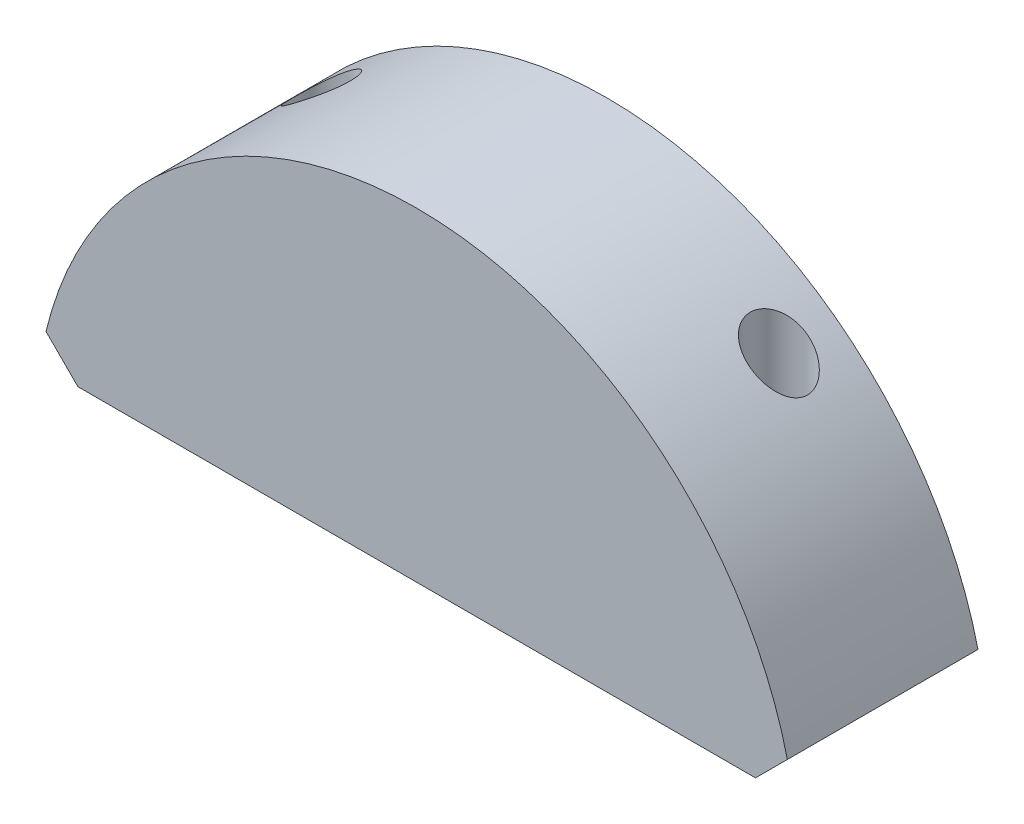
ISO-10303-21;
HEADER;
FILE_DESCRIPTION(('STEP AP214'),'2;1');
FILE_NAME('part.step','',(''),(''),'','','');
FILE_SCHEMA(('AUTOMOTIVE_DESIGN { 1 0 10303 214 1 1 1 1 }'));
ENDSEC;
DATA;
#1=APPLICATION_CONTEXT('core data for automotive mechanical design processes');
#2=APPLICATION_PROTOCOL_DEFINITION('international standard','automotive_design',2000,#1);
#3=PRODUCT_CONTEXT('',#1,'mechanical');
#4=PRODUCT('Part','Part','',(#3));
#5=PRODUCT_RELATED_PRODUCT_CATEGORY('part','',(#4));
#6=PRODUCT_DEFINITION_FORMATION('','',#4);
#7=PRODUCT_DEFINITION_CONTEXT('part definition',#1,'design');
#8=PRODUCT_DEFINITION('design','',#6,#7);
#9=PRODUCT_DEFINITION_SHAPE('','',#8);
#10=(LENGTH_UNIT() NAMED_UNIT(*) SI_UNIT(.MILLI.,.METRE.));
#11=(NAMED_UNIT(*) PLANE_ANGLE_UNIT() SI_UNIT($,.RADIAN.));
#12=(NAMED_UNIT(*) SI_UNIT($,.STERADIAN.) SOLID_ANGLE_UNIT());
#13=UNCERTAINTY_MEASURE_WITH_UNIT(LENGTH_MEASURE(1.E-05),#10,'distance_accuracy_value','');
#14=(GEOMETRIC_REPRESENTATION_CONTEXT(3) GLOBAL_UNCERTAINTY_ASSIGNED_CONTEXT((#13)) GLOBAL_UNIT_ASSIGNED_CONTEXT((#10,
#11,#12)) REPRESENTATION_CONTEXT('',''));
#15=CARTESIAN_POINT('',(0.,0.,0.));
#16=DIRECTION('',(0.,0.,1.));
#17=DIRECTION('',(1.,0.,0.));
#18=AXIS2_PLACEMENT_3D('',#15,#16,#17);
#19=CARTESIAN_POINT('',(-19.4464743814244,4.67275444813921,10.));
#20=DIRECTION('',(0.707106781186549,0.707106781186546,0.));
#21=DIRECTION('',(-0.707106781186546,0.707106781186549,0.));
#22=AXIS2_PLACEMENT_3D('',#19,#20,#21);
#23=PLANE('',#22);
#24=DIRECTION('',(0.707106781186546,-0.707106781186549,0.));
#25=VECTOR('',#24,1.);
#26=CARTESIAN_POINT('',(-19.4464743814244,4.67275444813921,0.));
#27=LINE('',#26,#25);
#28=CARTESIAN_POINT('',(-19.4464743814244,4.67275444813921,0.));
#29=VERTEX_POINT('',#28);
#30=CARTESIAN_POINT('',(-17.7737199332852,3.,0.));
#31=VERTEX_POINT('',#30);
#32=EDGE_CURVE('E100',#29,#31,#27,.T.);
#33=ORIENTED_EDGE('',*,*,#32,.T.);
#34=DIRECTION('',(0.,0.,-1.));
#35=VECTOR('',#34,1.);
#36=CARTESIAN_POINT('',(-17.7737199332852,3.,10.));
#37=LINE('',#36,#35);
#38=CARTESIAN_POINT('',(-17.7737199332852,3.,10.));
#39=VERTEX_POINT('',#38);
#40=EDGE_CURVE('E11',#39,#31,#37,.T.);
#41=ORIENTED_EDGE('',*,*,#40,.F.);
#42=DIRECTION('',(0.707106781186546,-0.707106781186549,0.));
#43=VECTOR('',#42,1.);
#44=CARTESIAN_POINT('',(-19.4464743814244,4.67275444813921,10.));
#45=LINE('',#44,#43);
#46=CARTESIAN_POINT('',(-19.4464743814244,4.67275444813921,10.));
#47=VERTEX_POINT('',#46);
#48=EDGE_CURVE('E87',#47,#39,#45,.T.);
#49=ORIENTED_EDGE('',*,*,#48,.F.);
#50=DIRECTION('',(0.,0.,-1.));
#51=VECTOR('',#50,1.);
#52=CARTESIAN_POINT('',(-19.4464743814244,4.67275444813921,10.));
#53=LINE('',#52,#51);
#54=EDGE_CURVE('E96',#47,#29,#53,.T.);
#55=ORIENTED_EDGE('',*,*,#54,.T.);
#56=EDGE_LOOP('',(#33,#41,#49,#55));
#57=FACE_BOUND('',#56,.T.);
#58=ADVANCED_FACE('F30',(#57),#23,.F.);
#59=CARTESIAN_POINT('',(17.7737199332852,3.,10.));
#60=DIRECTION('',(0.,1.,0.));
#61=DIRECTION('',(0.,0.,1.));
#62=AXIS2_PLACEMENT_3D('',#59,#60,#61);
#63=PLANE('',#62);
#64=CARTESIAN_POINT('',(12.,3.,3.));
#65=DIRECTION('',(0.,-1.,0.));
#66=DIRECTION('',(0.,0.,1.));
#67=AXIS2_PLACEMENT_3D('',#64,#65,#66);
#68=CIRCLE('',#67,1.5);
#69=CARTESIAN_POINT('',(12.,3.,4.5));
#70=VERTEX_POINT('',#69);
#71=EDGE_CURVE('E148',#70,#70,#68,.T.);
#72=ORIENTED_EDGE('',*,*,#71,.F.);
#73=EDGE_LOOP('',(#72));
#74=FACE_BOUND('',#73,.T.);
#75=CARTESIAN_POINT('',(-12.,3.,3.));
#76=DIRECTION('',(0.,-1.,0.));
#77=DIRECTION('',(0.,0.,-1.));
#78=AXIS2_PLACEMENT_3D('',#75,#76,#77);
#79=CIRCLE('',#78,1.5);
#80=CARTESIAN_POINT('',(-12.,3.,1.5));
#81=VERTEX_POINT('',#80);
#82=EDGE_CURVE('E112',#81,#81,#79,.T.);
#83=ORIENTED_EDGE('',*,*,#82,.F.);
#84=EDGE_LOOP('',(#83));
#85=FACE_BOUND('',#84,.T.);
#86=DIRECTION('',(1.,0.,0.));
#87=VECTOR('',#86,1.);
#88=CARTESIAN_POINT('',(17.7737199332852,3.,0.));
#89=LINE('',#88,#87);
#90=CARTESIAN_POINT('',(17.7737199332852,3.,0.));
#91=VERTEX_POINT('',#90);
#92=EDGE_CURVE('E91',#31,#91,#89,.T.);
#93=ORIENTED_EDGE('',*,*,#92,.T.);
#94=DIRECTION('',(0.,0.,-1.));
#95=VECTOR('',#94,1.);
#96=CARTESIAN_POINT('',(17.7737199332852,3.,10.));
#97=LINE('',#96,#95);
#98=CARTESIAN_POINT('',(17.7737199332852,3.,10.));
#99=VERTEX_POINT('',#98);
#100=EDGE_CURVE('E43',#99,#91,#97,.T.);
#101=ORIENTED_EDGE('',*,*,#100,.F.);
#102=DIRECTION('',(1.,0.,0.));
#103=VECTOR('',#102,1.);
#104=CARTESIAN_POINT('',(17.7737199332852,3.,10.));
#105=LINE('',#104,#103);
#106=EDGE_CURVE('E82',#39,#99,#105,.T.);
#107=ORIENTED_EDGE('',*,*,#106,.F.);
#108=ORIENTED_EDGE('',*,*,#40,.T.);
#109=EDGE_LOOP('',(#93,#101,#107,#108));
#110=FACE_BOUND('',#109,.T.);
#111=ADVANCED_FACE('F90',(#74,#85,#110),#63,.F.);
#112=CARTESIAN_POINT('',(19.4464743814244,4.67275444813921,10.));
#113=DIRECTION('',(-0.707106781186549,0.707106781186546,0.));
#114=DIRECTION('',(-0.707106781186546,-0.707106781186549,0.));
#115=AXIS2_PLACEMENT_3D('',#112,#113,#114);
#116=PLANE('',#115);
#117=DIRECTION('',(0.707106781186546,0.707106781186549,0.));
#118=VECTOR('',#117,1.);
#119=CARTESIAN_POINT('',(19.4464743814244,4.67275444813921,0.));
#120=LINE('',#119,#118);
#121=CARTESIAN_POINT('',(19.4464743814244,4.67275444813921,0.));
#122=VERTEX_POINT('',#121);
#123=EDGE_CURVE('E69',#91,#122,#120,.T.);
#124=ORIENTED_EDGE('',*,*,#123,.T.);
#125=DIRECTION('',(0.,0.,-1.));
#126=VECTOR('',#125,1.);
#127=CARTESIAN_POINT('',(19.4464743814244,4.67275444813921,10.));
#128=LINE('',#127,#126);
#129=CARTESIAN_POINT('',(19.4464743814244,4.67275444813921,10.));
#130=VERTEX_POINT('',#129);
#131=EDGE_CURVE('E92',#130,#122,#128,.T.);
#132=ORIENTED_EDGE('',*,*,#131,.F.);
#133=DIRECTION('',(0.707106781186546,0.707106781186549,0.));
#134=VECTOR('',#133,1.);
#135=CARTESIAN_POINT('',(19.4464743814244,4.67275444813921,10.));
#136=LINE('',#135,#134);
#137=EDGE_CURVE('E85',#99,#130,#136,.T.);
#138=ORIENTED_EDGE('',*,*,#137,.F.);
#139=ORIENTED_EDGE('',*,*,#100,.T.);
#140=EDGE_LOOP('',(#124,#132,#138,#139));
#141=FACE_BOUND('',#140,.T.);
#142=ADVANCED_FACE('F94',(#141),#116,.F.);
#143=CARTESIAN_POINT('',(0.,0.,10.));
#144=DIRECTION('',(0.,0.,-1.));
#145=DIRECTION('',(-1.,0.,0.));
#146=AXIS2_PLACEMENT_3D('',#143,#144,#145);
#147=CYLINDRICAL_SURFACE('',#146,20.);
#148=CARTESIAN_POINT('',(12.,16.,1.5));
#149=CARTESIAN_POINT('',(12.1016605629213,15.9237532135887,1.50000004935669));
#150=CARTESIAN_POINT('',(12.2026127311578,15.8465127533473,1.51032097749191));
#151=CARTESIAN_POINT('',(12.400646022508,15.692029679866,1.55095839595559));
#152=CARTESIAN_POINT('',(12.4977205734092,15.6147872679916,1.58130742401025));
#153=CARTESIAN_POINT('',(12.6897064755142,15.4592138939535,1.6636898259232));
#154=CARTESIAN_POINT('',(12.7843139264481,15.3809957521567,1.71665472820429));
#155=CARTESIAN_POINT('',(12.9629089448135,15.2307751019965,1.8446545508195));
#156=CARTESIAN_POINT('',(13.0469231451528,15.1587571563415,1.91963247924919));
#157=CARTESIAN_POINT('',(13.1708907683445,15.0509697154233,2.05968444424559));
#158=CARTESIAN_POINT('',(13.2155595966016,15.0117279077581,2.11794607225101));
#159=CARTESIAN_POINT('',(13.2971797886314,14.9394765813178,2.24310888920046));
#160=CARTESIAN_POINT('',(13.3341434417936,14.9064571463541,2.30999604067372));
#161=CARTESIAN_POINT('',(13.3928015616609,14.8537589270902,2.43942400994441));
#162=CARTESIAN_POINT('',(13.4160296580088,14.8327617291017,2.50072726708063));
#163=CARTESIAN_POINT('',(13.4545746078482,14.7978073911107,2.62770451371876));
#164=CARTESIAN_POINT('',(13.4698962264855,14.7838460108185,2.69337584362389));
#165=CARTESIAN_POINT('',(13.4916421076157,14.7640041775769,2.82778097939976));
#166=CARTESIAN_POINT('',(13.4980169893861,14.7581685755147,2.89652963762857));
#167=CARTESIAN_POINT('',(13.5011884754028,14.755267420131,3.03442992687101));
#168=CARTESIAN_POINT('',(13.4979872687585,14.7581998624203,3.10358146217928));
#169=CARTESIAN_POINT('',(13.4830012003276,14.7718909613274,3.23367914475481));
#170=CARTESIAN_POINT('',(13.472021382519,14.7819154999464,3.2948005649622));
#171=CARTESIAN_POINT('',(13.4430616303673,14.8082569634209,3.41392436688357));
#172=CARTESIAN_POINT('',(13.4250804124258,14.8245750420944,3.47192617444432));
#173=CARTESIAN_POINT('',(13.3816034948475,14.8638351659176,3.58757468259506));
#174=CARTESIAN_POINT('',(13.3556818304176,14.8871505567923,3.64493207249858));
#175=CARTESIAN_POINT('',(13.2980418159378,14.93866067761,3.75426441770425));
#176=CARTESIAN_POINT('',(13.2663196593158,14.9668586110726,3.80623580314361));
#177=CARTESIAN_POINT('',(13.1803316644731,15.0427260154491,3.9301005770873));
#178=CARTESIAN_POINT('',(13.1229220222838,15.0928947956917,3.99829629684761));
#179=CARTESIAN_POINT('',(12.9998708818308,15.1990132172518,4.12155049099019));
#180=CARTESIAN_POINT('',(12.9342108196884,15.2549758433967,4.17657849984266));
#181=CARTESIAN_POINT('',(12.7798704471203,15.384647055898,4.28560543116446));
#182=CARTESIAN_POINT('',(12.6894951910277,15.4593402629862,4.3360376663896));
#183=CARTESIAN_POINT('',(12.5022544047574,15.6111562300716,4.41709380697448));
#184=CARTESIAN_POINT('',(12.4053874483738,15.6882795219658,4.44771334369915));
#185=CARTESIAN_POINT('',(12.2069126063822,15.8432077026678,4.48913684669305));
#186=CARTESIAN_POINT('',(12.1052767364364,15.9210136356196,4.49980331807073));
#187=CARTESIAN_POINT('',(11.9004066568021,16.0747230306896,4.50019129806755));
#188=CARTESIAN_POINT('',(11.7971717440038,16.1506256151288,4.48990331756371));
#189=CARTESIAN_POINT('',(11.5899659066436,16.2999799219,4.44683044842385));
#190=CARTESIAN_POINT('',(11.4860287279132,16.3733410304183,4.41355576711111));
#191=CARTESIAN_POINT('',(11.2842193016896,16.5130665721538,4.32281232383724));
#192=CARTESIAN_POINT('',(11.1863337294807,16.5794466204968,4.26539905840293));
#193=CARTESIAN_POINT('',(11.0315673658264,16.6826343905496,4.14819763134881));
#194=CARTESIAN_POINT('',(10.9715216369123,16.7221477658731,4.09492647133967));
#195=CARTESIAN_POINT('',(10.8591649159862,16.7953271487328,3.97728953681393));
#196=CARTESIAN_POINT('',(10.806849595253,16.8289964305881,3.91293001540785));
#197=CARTESIAN_POINT('',(10.7121014961134,16.8894665285848,3.77360389767993));
#198=CARTESIAN_POINT('',(10.6697416979466,16.9162167589897,3.69856507407423));
#199=CARTESIAN_POINT('',(10.5979555941409,16.9612839160065,3.54019315187877));
#200=CARTESIAN_POINT('',(10.5685197408551,16.979607068653,3.45686623218194));
#201=CARTESIAN_POINT('',(10.5273605290395,17.0051519510712,3.29560140167121));
#202=CARTESIAN_POINT('',(10.5138907603318,17.0134701997499,3.21828040882406));
#203=CARTESIAN_POINT('',(10.4992362845085,17.0225179869444,3.06205860237886));
#204=CARTESIAN_POINT('',(10.4980447598979,17.023251736754,2.9831586898644));
#205=CARTESIAN_POINT('',(10.5076087948478,17.0173493215066,2.8326505627828));
#206=CARTESIAN_POINT('',(10.5174310204263,17.0112889192493,2.76095738189619));
#207=CARTESIAN_POINT('',(10.5470279795145,16.9929544491812,2.62049671268837));
#208=CARTESIAN_POINT('',(10.5668022281685,16.9806806840812,2.55172908201334));
#209=CARTESIAN_POINT('',(10.6156676939691,16.950175007428,2.41796748732423));
#210=CARTESIAN_POINT('',(10.6448759171302,16.9318682092376,2.35303371512348));
#211=CARTESIAN_POINT('',(10.711248859622,16.8899580945463,2.22924846857253));
#212=CARTESIAN_POINT('',(10.748415802057,16.8663532980698,2.17039870048799));
#213=CARTESIAN_POINT('',(10.8329398860586,16.8122022490995,2.05472177457169));
#214=CARTESIAN_POINT('',(10.8809116539043,16.781223570887,1.99854817905675));
#215=CARTESIAN_POINT('',(10.9828767468486,16.7146680692949,1.89512800668807));
#216=CARTESIAN_POINT('',(11.0368729409546,16.679089053808,1.8478857122846));
#217=CARTESIAN_POINT('',(11.1574088396454,16.5987406196212,1.7563920114594));
#218=CARTESIAN_POINT('',(11.2246335533111,16.553386112853,1.71355962226389));
#219=CARTESIAN_POINT('',(11.3627962910017,16.4588542389145,1.63981128319862));
#220=CARTESIAN_POINT('',(11.4337361929509,16.4096749322021,1.60890142717381));
#221=CARTESIAN_POINT('',(11.5867739353569,16.3020390843075,1.55548706424555));
#222=CARTESIAN_POINT('',(11.6691455209899,16.2431971369261,1.53454650227289));
#223=CARTESIAN_POINT('',(11.8345001333518,16.1231224094826,1.50679968712444));
#224=CARTESIAN_POINT('',(11.9174834246622,16.0618885388235,1.4999999599378));
#225=CARTESIAN_POINT('',(12.,16.,1.5));
#226=B_SPLINE_CURVE_WITH_KNOTS('',3,(#148,#149,#150,#151,#152,#153,#154,#155,#156,#157,#158,
#159,#160,#161,#162,#163,#164,#165,#166,#167,#168,#169,#170,#171,#172,#173,#174,#175,#176,#177,
#178,#179,#180,#181,#182,#183,#184,#185,#186,#187,#188,#189,#190,#191,#192,#193,#194,#195,#196,
#197,#198,#199,#200,#201,#202,#203,#204,#205,#206,#207,#208,#209,#210,#211,#212,#213,#214,#215,
#216,#217,#218,#219,#220,#221,#222,#223,#224,#225),.UNSPECIFIED.,.T.,.F.,(4,2,2,2,2,2,2,2,2,2,2,
2,2,2,2,2,2,2,2,2,2,2,2,2,2,2,2,2,2,2,2,2,2,2,2,2,2,2,4),(0.,0.380888747448679,
0.762397816573691,1.16142131309411,1.55942070996349,1.80831992799634,2.0568190736621,
2.26249204307297,2.46804091048419,2.67471988367374,2.88135161332349,3.06923797234161,
3.25715879364833,3.45778881821749,3.65855098185161,3.96373327729259,4.26961497597764,
4.65056330466912,5.03159560261999,5.41524402539658,5.79906622014662,6.19132971875762,
6.5826962617878,6.85005253143594,7.11725852021268,7.38636612164722,7.6552745822342,
7.89076947911889,8.12613361041182,8.34296500964324,8.55978584602022,8.7794063241254,
8.99908822889552,9.23845155373437,9.47792936089045,9.7520175092024,10.0262455643914,
10.3352654956433,10.644428007841),.UNSPECIFIED.);
#227=CARTESIAN_POINT('',(12.,16.,1.5));
#228=VERTEX_POINT('',#227);
#229=EDGE_CURVE('E33',#228,#228,#226,.T.);
#230=ORIENTED_EDGE('',*,*,#229,.T.);
#231=EDGE_LOOP('',(#230));
#232=FACE_BOUND('',#231,.T.);
#233=CARTESIAN_POINT('',(-12.,16.,1.5));
#234=CARTESIAN_POINT('',(-11.8980876048335,16.0764323170644,1.5000003600341));
#235=CARTESIAN_POINT('',(-11.795374042595,16.1519339106007,1.51037246279794));
#236=CARTESIAN_POINT('',(-11.5913536327377,16.2989669800117,1.55298029084801));
#237=CARTESIAN_POINT('',(-11.490048209334,16.3704946286235,1.58523671089141));
#238=CARTESIAN_POINT('',(-11.3142543425323,16.4923175647519,1.66324681195698));
#239=CARTESIAN_POINT('',(-11.238684524381,16.5438706292671,1.70460518809169));
#240=CARTESIAN_POINT('',(-11.0935488275665,16.6415381162207,1.80169184783767));
#241=CARTESIAN_POINT('',(-11.0239734845288,16.6876611556738,1.85739690400877));
#242=CARTESIAN_POINT('',(-10.9036247460083,16.7664950196489,1.9734244783802));
#243=CARTESIAN_POINT('',(-10.8515983746704,16.8001794997242,2.03178224968919));
#244=CARTESIAN_POINT('',(-10.7561004107026,16.8614804890711,2.15799817758912));
#245=CARTESIAN_POINT('',(-10.7126274551483,16.8890979651574,2.22585481765071));
#246=CARTESIAN_POINT('',(-10.6361897009943,16.9373414907645,2.37014029400427));
#247=CARTESIAN_POINT('',(-10.6032891874942,16.9579248158376,2.44661788923494));
#248=CARTESIAN_POINT('',(-10.5503692934813,16.9909003915396,2.60557412620413));
#249=CARTESIAN_POINT('',(-10.5303416713673,17.0032978831174,2.68804889064996));
#250=CARTESIAN_POINT('',(-10.5059450850056,17.0183811355177,2.84666531717342));
#251=CARTESIAN_POINT('',(-10.5000833890813,17.0219930061228,2.92249230541015));
#252=CARTESIAN_POINT('',(-10.4999184896842,17.0220948966151,3.07414954399625));
#253=CARTESIAN_POINT('',(-10.5056110395502,17.0185875331139,3.14997978290739));
#254=CARTESIAN_POINT('',(-10.5276429980599,17.0049664536379,3.29547769185223));
#255=CARTESIAN_POINT('',(-10.5434291725354,16.9951959546369,3.36526304483569));
#256=CARTESIAN_POINT('',(-10.5843294661826,16.969753845377,3.50089488696362));
#257=CARTESIAN_POINT('',(-10.6094442044875,16.9540818434367,3.566741114333));
#258=CARTESIAN_POINT('',(-10.6689917240703,16.9166749481416,3.69543796905904));
#259=CARTESIAN_POINT('',(-10.7037411921448,16.894733040342,3.75808090296772));
#260=CARTESIAN_POINT('',(-10.7806361565001,16.8457697707144,3.87643513553549));
#261=CARTESIAN_POINT('',(-10.822784220928,16.8187466448983,3.9321440157829));
#262=CARTESIAN_POINT('',(-10.9178890891895,16.7571845534856,4.04155760309163));
#263=CARTESIAN_POINT('',(-10.9715220318902,16.7221486702822,4.09439267118534));
#264=CARTESIAN_POINT('',(-11.0841830982763,16.6476860793537,4.1902774291558));
#265=CARTESIAN_POINT('',(-11.1432139512592,16.6082571481853,4.23332213002933));
#266=CARTESIAN_POINT('',(-11.274541163793,16.5194409670355,4.31552589431466));
#267=CARTESIAN_POINT('',(-11.3474700975539,16.4694598846249,4.35303035551361));
#268=CARTESIAN_POINT('',(-11.4962221492973,16.365974093831,4.41517346469698));
#269=CARTESIAN_POINT('',(-11.57204683658,16.3124674631152,4.43980502715793));
#270=CARTESIAN_POINT('',(-11.7381442890676,16.1934588757011,4.47984368956888));
#271=CARTESIAN_POINT('',(-11.8286439442075,16.1274849369142,4.4929128422832));
#272=CARTESIAN_POINT('',(-12.0091013673207,15.9935657699963,4.50269618316554));
#273=CARTESIAN_POINT('',(-12.0990586138851,15.9256189261905,4.49939656809969));
#274=CARTESIAN_POINT('',(-12.2890846402055,15.7795653555701,4.47541502690279));
#275=CARTESIAN_POINT('',(-12.3887946092472,15.7013746346254,4.45235201009592));
#276=CARTESIAN_POINT('',(-12.5825891709098,15.5465051671632,4.38603019746868));
#277=CARTESIAN_POINT('',(-12.6766737297221,15.4698264297345,4.34277128028547));
#278=CARTESIAN_POINT('',(-12.8411398943842,15.3334455836701,4.24499890082287));
#279=CARTESIAN_POINT('',(-12.9128361125113,15.2730688976113,4.1936358138155));
#280=CARTESIAN_POINT('',(-13.0483034816434,15.1574951967083,4.07659138836794));
#281=CARTESIAN_POINT('',(-13.1120862077628,15.1022906462167,4.0109313591837));
#282=CARTESIAN_POINT('',(-13.2148223778713,15.0123937614299,3.8827425817465));
#283=CARTESIAN_POINT('',(-13.2560565832223,14.9759628036903,3.82326569708388));
#284=CARTESIAN_POINT('',(-13.3306489346558,14.9096037748145,3.69625877104046));
#285=CARTESIAN_POINT('',(-13.3640173563308,14.8796672237292,3.62873941171168));
#286=CARTESIAN_POINT('',(-13.4160912652458,14.8327177492785,3.49872011198761));
#287=CARTESIAN_POINT('',(-13.4363251312712,14.8143729529233,3.43731832757045));
#288=CARTESIAN_POINT('',(-13.4688959978802,14.7847668318338,3.31080612958904));
#289=CARTESIAN_POINT('',(-13.4812382565596,14.7735007906854,3.24569821694375));
#290=CARTESIAN_POINT('',(-13.4972125275386,14.7589084124947,3.11323211597964));
#291=CARTESIAN_POINT('',(-13.5008065126064,14.7556167389417,3.04586538928481));
#292=CARTESIAN_POINT('',(-13.498888726625,14.7573711983825,2.91137397683958));
#293=CARTESIAN_POINT('',(-13.4933773865565,14.7624169367433,2.84424927978396));
#294=CARTESIAN_POINT('',(-13.4743664275154,14.7797697752896,2.71698321890953));
#295=CARTESIAN_POINT('',(-13.4614456888825,14.7915505002326,2.65667996533801));
#296=CARTESIAN_POINT('',(-13.4288598155293,14.8211405270667,2.53949536743534));
#297=CARTESIAN_POINT('',(-13.409192016344,14.8389522105928,2.48261538542665));
#298=CARTESIAN_POINT('',(-13.3564790722021,14.886440101642,2.35486471316348));
#299=CARTESIAN_POINT('',(-13.3211599585108,14.9180920605353,2.28566605417657));
#300=CARTESIAN_POINT('',(-13.2422954098062,14.9881420541817,2.15590632220091));
#301=CARTESIAN_POINT('',(-13.1987348329528,15.0265524968956,2.09536151394654));
#302=CARTESIAN_POINT('',(-13.0908551109943,15.1207161398019,1.9660109217337));
#303=CARTESIAN_POINT('',(-13.0242636211823,15.1781786427428,1.90035103105235));
#304=CARTESIAN_POINT('',(-12.8830820444135,15.2981964808271,1.78404266330934));
#305=CARTESIAN_POINT('',(-12.8084817401896,15.3607582963496,1.73341367942219));
#306=CARTESIAN_POINT('',(-12.6519333620279,15.4899672505474,1.64605381787775));
#307=CARTESIAN_POINT('',(-12.5698699134902,15.5566704339982,1.60961485293945));
#308=CARTESIAN_POINT('',(-12.4016331516331,15.6911140433194,1.55204375884532));
#309=CARTESIAN_POINT('',(-12.3154680566121,15.7588522245281,1.53088228976567));
#310=CARTESIAN_POINT('',(-12.1527976286699,15.8845389200665,1.50586275371052));
#311=CARTESIAN_POINT('',(-12.0766252699605,15.9425325357214,1.49999972929976));
#312=CARTESIAN_POINT('',(-12.,16.,1.5));
#313=B_SPLINE_CURVE_WITH_KNOTS('',3,(#233,#234,#235,#236,#237,#238,#239,#240,#241,#242,#243,
#244,#245,#246,#247,#248,#249,#250,#251,#252,#253,#254,#255,#256,#257,#258,#259,#260,#261,#262,
#263,#264,#265,#266,#267,#268,#269,#270,#271,#272,#273,#274,#275,#276,#277,#278,#279,#280,#281,
#282,#283,#284,#285,#286,#287,#288,#289,#290,#291,#292,#293,#294,#295,#296,#297,#298,#299,#300,
#301,#302,#303,#304,#305,#306,#307,#308,#309,#310,#311,#312),.UNSPECIFIED.,.T.,.F.,(4,2,2,2,2,2,
2,2,2,2,2,2,2,2,2,2,2,2,2,2,2,2,2,2,2,2,2,2,2,2,2,2,2,2,2,2,2,2,2,4),(0.,0.381852199418809,
0.764065999032913,1.06407114404965,1.36359359760288,1.6179247857578,1.87221541521554,
2.12802420556192,2.38366905608251,2.61090583488865,2.8380591099448,3.05371988379746,
3.26939497353044,3.49323274921014,3.7171483760326,3.9653010717218,4.21357993985852,
4.50060331369063,4.78778450548272,5.12472758268657,5.46195484098148,5.84664473760215,
6.23133694596236,6.55082545209374,6.86984098854433,7.11205322940871,7.35394727680873,
7.55471734421932,7.75535350083712,7.9568602429058,8.15835744736855,8.34591796191896,
8.5335526309587,8.78385434465488,9.03462047772725,9.36216090756058,9.69012427850932,
10.024516974717,10.3582657600676,10.6453704622747),.UNSPECIFIED.);
#314=CARTESIAN_POINT('',(-12.,16.,1.5));
#315=VERTEX_POINT('',#314);
#316=EDGE_CURVE('E103',#315,#315,#313,.T.);
#317=ORIENTED_EDGE('',*,*,#316,.T.);
#318=EDGE_LOOP('',(#317));
#319=FACE_BOUND('',#318,.T.);
#320=CARTESIAN_POINT('',(0.,0.,0.));
#321=DIRECTION('',(0.,0.,1.));
#322=DIRECTION('',(1.,0.,0.));
#323=AXIS2_PLACEMENT_3D('',#320,#321,#322);
#324=CIRCLE('',#323,20.);
#325=EDGE_CURVE('E75',#122,#29,#324,.T.);
#326=ORIENTED_EDGE('',*,*,#325,.T.);
#327=ORIENTED_EDGE('',*,*,#54,.F.);
#328=CARTESIAN_POINT('',(0.,0.,10.));
#329=DIRECTION('',(0.,0.,1.));
#330=DIRECTION('',(1.,0.,0.));
#331=AXIS2_PLACEMENT_3D('',#328,#329,#330);
#332=CIRCLE('',#331,20.);
#333=EDGE_CURVE('E52',#130,#47,#332,.T.);
#334=ORIENTED_EDGE('',*,*,#333,.F.);
#335=ORIENTED_EDGE('',*,*,#131,.T.);
#336=EDGE_LOOP('',(#326,#327,#334,#335));
#337=FACE_BOUND('',#336,.T.);
#338=ADVANCED_FACE('F113',(#232,#319,#337),#147,.T.);
#339=CARTESIAN_POINT('',(0.,0.,10.));
#340=DIRECTION('',(0.,0.,1.));
#341=DIRECTION('',(1.,0.,0.));
#342=AXIS2_PLACEMENT_3D('',#339,#340,#341);
#343=PLANE('',#342);
#344=ORIENTED_EDGE('',*,*,#48,.T.);
#345=ORIENTED_EDGE('',*,*,#106,.T.);
#346=ORIENTED_EDGE('',*,*,#137,.T.);
#347=ORIENTED_EDGE('',*,*,#333,.T.);
#348=EDGE_LOOP('',(#344,#345,#346,#347));
#349=FACE_BOUND('',#348,.T.);
#350=ADVANCED_FACE('F83',(#349),#343,.T.);
#351=CARTESIAN_POINT('',(0.,0.,0.));
#352=DIRECTION('',(0.,0.,1.));
#353=DIRECTION('',(1.,0.,0.));
#354=AXIS2_PLACEMENT_3D('',#351,#352,#353);
#355=PLANE('',#354);
#356=ORIENTED_EDGE('',*,*,#32,.F.);
#357=ORIENTED_EDGE('',*,*,#325,.F.);
#358=ORIENTED_EDGE('',*,*,#123,.F.);
#359=ORIENTED_EDGE('',*,*,#92,.F.);
#360=EDGE_LOOP('',(#356,#357,#358,#359));
#361=FACE_BOUND('',#360,.T.);
#362=ADVANCED_FACE('F122',(#361),#355,.F.);
#363=CARTESIAN_POINT('',(-12.,20.,3.));
#364=DIRECTION('',(0.,-1.,0.));
#365=DIRECTION('',(0.,0.,-1.));
#366=AXIS2_PLACEMENT_3D('',#363,#364,#365);
#367=CYLINDRICAL_SURFACE('',#366,1.5);
#368=ORIENTED_EDGE('',*,*,#82,.T.);
#369=EDGE_LOOP('',(#368));
#370=FACE_BOUND('',#369,.T.);
#371=ORIENTED_EDGE('',*,*,#316,.F.);
#372=EDGE_LOOP('',(#371));
#373=FACE_BOUND('',#372,.T.);
#374=ADVANCED_FACE('F117',(#370,#373),#367,.F.);
#375=CARTESIAN_POINT('',(12.,20.,3.));
#376=DIRECTION('',(0.,-1.,0.));
#377=DIRECTION('',(0.,0.,-1.));
#378=AXIS2_PLACEMENT_3D('',#375,#376,#377);
#379=CYLINDRICAL_SURFACE('',#378,1.5);
#380=ORIENTED_EDGE('',*,*,#71,.T.);
#381=EDGE_LOOP('',(#380));
#382=FACE_BOUND('',#381,.T.);
#383=ORIENTED_EDGE('',*,*,#229,.F.);
#384=EDGE_LOOP('',(#383));
#385=FACE_BOUND('',#384,.T.);
#386=ADVANCED_FACE('F121',(#382,#385),#379,.F.);
#387=CLOSED_SHELL('',(#58,#111,#142,#338,#350,#362,#374,#386));
#388=MANIFOLD_SOLID_BREP('B2',#387);
#389=ADVANCED_BREP_SHAPE_REPRESENTATION('',(#18,#388),#14);
#390=SHAPE_DEFINITION_REPRESENTATION(#9,#389);
ENDSEC;
END-ISO-10303-21;
